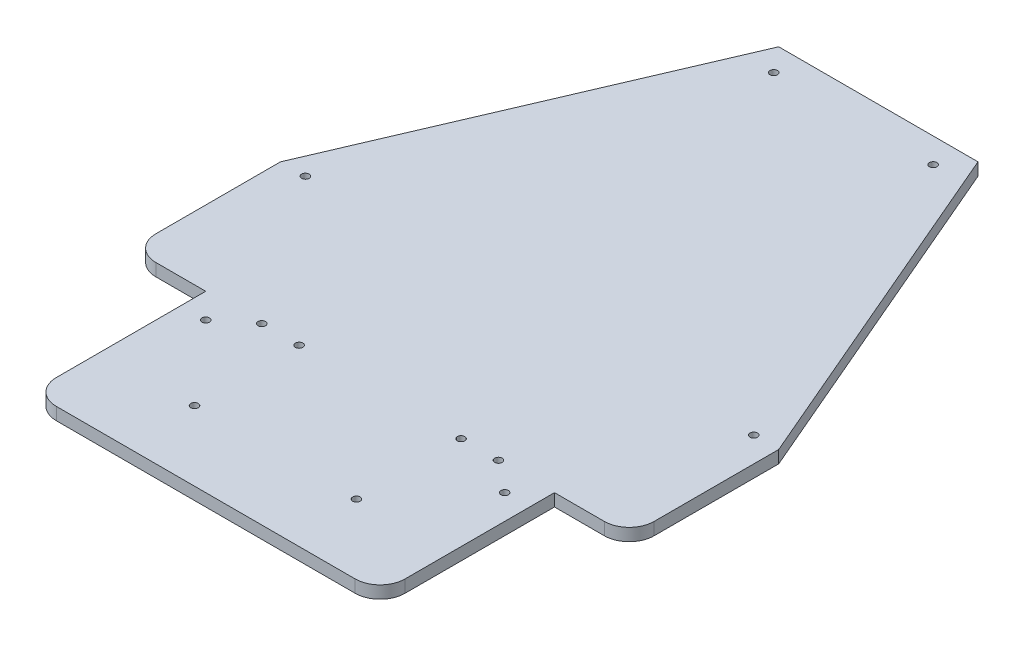
ISO-10303-21;
HEADER;
FILE_DESCRIPTION(('STEP AP214'),'2;1');
FILE_NAME('part.step','',(''),(''),'','','');
FILE_SCHEMA(('AUTOMOTIVE_DESIGN { 1 0 10303 214 1 1 1 1 }'));
ENDSEC;
DATA;
#1=APPLICATION_CONTEXT('core data for automotive mechanical design processes');
#2=APPLICATION_PROTOCOL_DEFINITION('international standard','automotive_design',2000,#1);
#3=PRODUCT_CONTEXT('',#1,'mechanical');
#4=PRODUCT('Part','Part','',(#3));
#5=PRODUCT_RELATED_PRODUCT_CATEGORY('part','',(#4));
#6=PRODUCT_DEFINITION_FORMATION('','',#4);
#7=PRODUCT_DEFINITION_CONTEXT('part definition',#1,'design');
#8=PRODUCT_DEFINITION('design','',#6,#7);
#9=PRODUCT_DEFINITION_SHAPE('','',#8);
#10=(LENGTH_UNIT() NAMED_UNIT(*) SI_UNIT(.MILLI.,.METRE.));
#11=(NAMED_UNIT(*) PLANE_ANGLE_UNIT() SI_UNIT($,.RADIAN.));
#12=(NAMED_UNIT(*) SI_UNIT($,.STERADIAN.) SOLID_ANGLE_UNIT());
#13=UNCERTAINTY_MEASURE_WITH_UNIT(LENGTH_MEASURE(1.E-05),#10,'distance_accuracy_value','');
#14=(GEOMETRIC_REPRESENTATION_CONTEXT(3) GLOBAL_UNCERTAINTY_ASSIGNED_CONTEXT((#13)) GLOBAL_UNIT_ASSIGNED_CONTEXT((#10,
#11,#12)) REPRESENTATION_CONTEXT('',''));
#15=CARTESIAN_POINT('',(0.,0.,0.));
#16=DIRECTION('',(0.,0.,1.));
#17=DIRECTION('',(1.,0.,0.));
#18=AXIS2_PLACEMENT_3D('',#15,#16,#17);
#19=CARTESIAN_POINT('',(90.,5.,40.));
#20=DIRECTION('',(0.,1.,0.));
#21=DIRECTION('',(0.,0.,1.));
#22=AXIS2_PLACEMENT_3D('',#19,#20,#21);
#23=PLANE('',#22);
#24=CARTESIAN_POINT('',(47.5,5.,50.));
#25=DIRECTION('',(0.,1.,0.));
#26=DIRECTION('',(0.,0.,1.));
#27=AXIS2_PLACEMENT_3D('',#24,#25,#26);
#28=CIRCLE('',#27,1.5);
#29=CARTESIAN_POINT('',(47.5,5.,51.5));
#30=VERTEX_POINT('',#29);
#31=EDGE_CURVE('E292',#30,#30,#28,.T.);
#32=ORIENTED_EDGE('',*,*,#31,.F.);
#33=EDGE_LOOP('',(#32));
#34=FACE_BOUND('',#33,.T.);
#35=CARTESIAN_POINT('',(32.5,5.,50.));
#36=DIRECTION('',(0.,1.,0.));
#37=DIRECTION('',(0.,0.,1.));
#38=AXIS2_PLACEMENT_3D('',#35,#36,#37);
#39=CIRCLE('',#38,1.5);
#40=CARTESIAN_POINT('',(32.5,5.,51.5));
#41=VERTEX_POINT('',#40);
#42=EDGE_CURVE('E668',#41,#41,#39,.T.);
#43=ORIENTED_EDGE('',*,*,#42,.F.);
#44=EDGE_LOOP('',(#43));
#45=FACE_BOUND('',#44,.T.);
#46=CARTESIAN_POINT('',(-32.5,5.,50.));
#47=DIRECTION('',(0.,1.,0.));
#48=DIRECTION('',(0.,0.,-1.));
#49=AXIS2_PLACEMENT_3D('',#46,#47,#48);
#50=CIRCLE('',#49,1.5);
#51=CARTESIAN_POINT('',(-32.5,5.,48.5));
#52=VERTEX_POINT('',#51);
#53=EDGE_CURVE('E672',#52,#52,#50,.T.);
#54=ORIENTED_EDGE('',*,*,#53,.F.);
#55=EDGE_LOOP('',(#54));
#56=FACE_BOUND('',#55,.T.);
#57=CARTESIAN_POINT('',(-32.5,5.,92.));
#58=DIRECTION('',(0.,1.,0.));
#59=DIRECTION('',(0.,0.,-1.));
#60=AXIS2_PLACEMENT_3D('',#57,#58,#59);
#61=CIRCLE('',#60,1.5);
#62=CARTESIAN_POINT('',(-32.5,5.,90.5));
#63=VERTEX_POINT('',#62);
#64=EDGE_CURVE('E678',#63,#63,#61,.T.);
#65=ORIENTED_EDGE('',*,*,#64,.F.);
#66=EDGE_LOOP('',(#65));
#67=FACE_BOUND('',#66,.T.);
#68=CARTESIAN_POINT('',(32.5,5.,92.));
#69=DIRECTION('',(0.,1.,0.));
#70=DIRECTION('',(0.,0.,1.));
#71=AXIS2_PLACEMENT_3D('',#68,#69,#70);
#72=CIRCLE('',#71,1.5);
#73=CARTESIAN_POINT('',(32.5,5.,93.5));
#74=VERTEX_POINT('',#73);
#75=EDGE_CURVE('E682',#74,#74,#72,.T.);
#76=ORIENTED_EDGE('',*,*,#75,.F.);
#77=EDGE_LOOP('',(#76));
#78=FACE_BOUND('',#77,.T.);
#79=CARTESIAN_POINT('',(-47.5,5.,50.));
#80=DIRECTION('',(0.,1.,0.));
#81=DIRECTION('',(0.,0.,-1.));
#82=AXIS2_PLACEMENT_3D('',#79,#80,#81);
#83=CIRCLE('',#82,1.5);
#84=CARTESIAN_POINT('',(-47.5,5.,48.5));
#85=VERTEX_POINT('',#84);
#86=EDGE_CURVE('E685',#85,#85,#83,.T.);
#87=ORIENTED_EDGE('',*,*,#86,.F.);
#88=EDGE_LOOP('',(#87));
#89=FACE_BOUND('',#88,.T.);
#90=CARTESIAN_POINT('',(-89.9999999999999,5.,-10.));
#91=DIRECTION('',(0.,1.,0.));
#92=DIRECTION('',(0.,0.,1.));
#93=AXIS2_PLACEMENT_3D('',#90,#91,#92);
#94=CIRCLE('',#93,1.50000000000001);
#95=CARTESIAN_POINT('',(-89.9999999999999,5.,-8.49999999999999));
#96=VERTEX_POINT('',#95);
#97=EDGE_CURVE('E274',#96,#96,#94,.T.);
#98=ORIENTED_EDGE('',*,*,#97,.F.);
#99=EDGE_LOOP('',(#98));
#100=FACE_BOUND('',#99,.T.);
#101=CARTESIAN_POINT('',(32.,5.,-140.));
#102=DIRECTION('',(0.,1.,0.));
#103=DIRECTION('',(0.,0.,-1.));
#104=AXIS2_PLACEMENT_3D('',#101,#102,#103);
#105=CIRCLE('',#104,1.49999999999999);
#106=CARTESIAN_POINT('',(32.,5.,-141.5));
#107=VERTEX_POINT('',#106);
#108=EDGE_CURVE('E310',#107,#107,#105,.T.);
#109=ORIENTED_EDGE('',*,*,#108,.F.);
#110=EDGE_LOOP('',(#109));
#111=FACE_BOUND('',#110,.T.);
#112=CARTESIAN_POINT('',(89.9999999999999,5.,-10.0000000000001));
#113=DIRECTION('',(0.,1.,0.));
#114=DIRECTION('',(0.,0.,-1.));
#115=AXIS2_PLACEMENT_3D('',#112,#113,#114);
#116=CIRCLE('',#115,1.49999999999998);
#117=CARTESIAN_POINT('',(89.9999999999999,5.,-11.5));
#118=VERTEX_POINT('',#117);
#119=EDGE_CURVE('E315',#118,#118,#116,.T.);
#120=ORIENTED_EDGE('',*,*,#119,.F.);
#121=EDGE_LOOP('',(#120));
#122=FACE_BOUND('',#121,.T.);
#123=CARTESIAN_POINT('',(-32.,5.,-140.));
#124=DIRECTION('',(0.,1.,0.));
#125=DIRECTION('',(0.,0.,1.));
#126=AXIS2_PLACEMENT_3D('',#123,#124,#125);
#127=CIRCLE('',#126,1.5);
#128=CARTESIAN_POINT('',(-32.,5.,-138.5));
#129=VERTEX_POINT('',#128);
#130=EDGE_CURVE('E321',#129,#129,#127,.T.);
#131=ORIENTED_EDGE('',*,*,#130,.F.);
#132=EDGE_LOOP('',(#131));
#133=FACE_BOUND('',#132,.T.);
#134=CARTESIAN_POINT('',(-60.,5.,59.9999999999999));
#135=DIRECTION('',(0.,1.,0.));
#136=DIRECTION('',(0.,0.,1.));
#137=AXIS2_PLACEMENT_3D('',#134,#135,#136);
#138=CIRCLE('',#137,1.5);
#139=CARTESIAN_POINT('',(-60.,5.,61.4999999999999));
#140=VERTEX_POINT('',#139);
#141=EDGE_CURVE('E189',#140,#140,#138,.T.);
#142=ORIENTED_EDGE('',*,*,#141,.F.);
#143=EDGE_LOOP('',(#142));
#144=FACE_BOUND('',#143,.T.);
#145=DIRECTION('',(1.,0.,0.));
#146=VECTOR('',#145,1.);
#147=CARTESIAN_POINT('',(70.,5.,50.));
#148=LINE('',#147,#146);
#149=CARTESIAN_POINT('',(70.,5.,50.));
#150=VERTEX_POINT('',#149);
#151=CARTESIAN_POINT('',(89.9999999999999,5.,50.));
#152=VERTEX_POINT('',#151);
#153=EDGE_CURVE('E227',#150,#152,#148,.T.);
#154=ORIENTED_EDGE('',*,*,#153,.T.);
#155=CARTESIAN_POINT('',(90.,5.,40.));
#156=DIRECTION('',(0.,1.,0.));
#157=DIRECTION('',(0.,0.,1.));
#158=AXIS2_PLACEMENT_3D('',#155,#156,#157);
#159=CIRCLE('',#158,9.99999999999999);
#160=CARTESIAN_POINT('',(100.,5.,39.9999999999999));
#161=VERTEX_POINT('',#160);
#162=EDGE_CURVE('E122',#152,#161,#159,.T.);
#163=ORIENTED_EDGE('',*,*,#162,.T.);
#164=DIRECTION('',(0.,0.,-1.));
#165=VECTOR('',#164,1.);
#166=CARTESIAN_POINT('',(100.,5.,39.9999999999999));
#167=LINE('',#166,#165);
#168=CARTESIAN_POINT('',(100.,5.,-9.99999999999999));
#169=VERTEX_POINT('',#168);
#170=EDGE_CURVE('E347',#161,#169,#167,.T.);
#171=ORIENTED_EDGE('',*,*,#170,.T.);
#172=DIRECTION('',(-0.393919298579168,0.,-0.919145030018058));
#173=VECTOR('',#172,1.);
#174=CARTESIAN_POINT('',(40.,5.,-150.));
#175=LINE('',#174,#173);
#176=CARTESIAN_POINT('',(40.,5.,-150.));
#177=VERTEX_POINT('',#176);
#178=EDGE_CURVE('E350',#169,#177,#175,.T.);
#179=ORIENTED_EDGE('',*,*,#178,.T.);
#180=DIRECTION('',(-1.,0.,0.));
#181=VECTOR('',#180,1.);
#182=CARTESIAN_POINT('',(-40.,5.,-150.));
#183=LINE('',#182,#181);
#184=CARTESIAN_POINT('',(-40.,5.,-150.));
#185=VERTEX_POINT('',#184);
#186=EDGE_CURVE('E353',#177,#185,#183,.T.);
#187=ORIENTED_EDGE('',*,*,#186,.T.);
#188=DIRECTION('',(-0.393919298579168,0.,0.919145030018058));
#189=VECTOR('',#188,1.);
#190=CARTESIAN_POINT('',(-40.,5.,-150.));
#191=LINE('',#190,#189);
#192=CARTESIAN_POINT('',(-100.,5.,-9.99999999999999));
#193=VERTEX_POINT('',#192);
#194=EDGE_CURVE('E356',#185,#193,#191,.T.);
#195=ORIENTED_EDGE('',*,*,#194,.T.);
#196=DIRECTION('',(0.,0.,1.));
#197=VECTOR('',#196,1.);
#198=CARTESIAN_POINT('',(-100.,5.,39.9999999999999));
#199=LINE('',#198,#197);
#200=CARTESIAN_POINT('',(-100.,5.,39.9999999999999));
#201=VERTEX_POINT('',#200);
#202=EDGE_CURVE('E359',#193,#201,#199,.T.);
#203=ORIENTED_EDGE('',*,*,#202,.T.);
#204=CARTESIAN_POINT('',(-90.,5.,40.));
#205=DIRECTION('',(0.,1.,0.));
#206=DIRECTION('',(0.,0.,-1.));
#207=AXIS2_PLACEMENT_3D('',#204,#205,#206);
#208=CIRCLE('',#207,9.99999999999999);
#209=CARTESIAN_POINT('',(-89.9999999999999,5.,50.));
#210=VERTEX_POINT('',#209);
#211=EDGE_CURVE('E362',#201,#210,#208,.T.);
#212=ORIENTED_EDGE('',*,*,#211,.T.);
#213=DIRECTION('',(1.,0.,0.));
#214=VECTOR('',#213,1.);
#215=CARTESIAN_POINT('',(-70.,5.,50.));
#216=LINE('',#215,#214);
#217=CARTESIAN_POINT('',(-70.,5.,50.));
#218=VERTEX_POINT('',#217);
#219=EDGE_CURVE('E365',#210,#218,#216,.T.);
#220=ORIENTED_EDGE('',*,*,#219,.T.);
#221=DIRECTION('',(0.,0.,1.));
#222=VECTOR('',#221,1.);
#223=CARTESIAN_POINT('',(-70.,5.,59.9999999999999));
#224=LINE('',#223,#222);
#225=CARTESIAN_POINT('',(-70.,5.,110.));
#226=VERTEX_POINT('',#225);
#227=EDGE_CURVE('E368',#218,#226,#224,.T.);
#228=ORIENTED_EDGE('',*,*,#227,.T.);
#229=CARTESIAN_POINT('',(-60.,5.,110.));
#230=DIRECTION('',(0.,1.,0.));
#231=DIRECTION('',(0.,0.,1.));
#232=AXIS2_PLACEMENT_3D('',#229,#230,#231);
#233=CIRCLE('',#232,10.);
#234=CARTESIAN_POINT('',(-59.9999999999999,5.,120.));
#235=VERTEX_POINT('',#234);
#236=EDGE_CURVE('E160',#226,#235,#233,.T.);
#237=ORIENTED_EDGE('',*,*,#236,.T.);
#238=DIRECTION('',(1.,0.,0.));
#239=VECTOR('',#238,1.);
#240=CARTESIAN_POINT('',(-59.9999999999999,5.,120.));
#241=LINE('',#240,#239);
#242=CARTESIAN_POINT('',(59.9999999999999,5.,120.));
#243=VERTEX_POINT('',#242);
#244=EDGE_CURVE('E153',#235,#243,#241,.T.);
#245=ORIENTED_EDGE('',*,*,#244,.T.);
#246=CARTESIAN_POINT('',(60.,5.,110.));
#247=DIRECTION('',(0.,1.,0.));
#248=DIRECTION('',(0.,0.,1.));
#249=AXIS2_PLACEMENT_3D('',#246,#247,#248);
#250=CIRCLE('',#249,10.);
#251=CARTESIAN_POINT('',(70.,5.,110.));
#252=VERTEX_POINT('',#251);
#253=EDGE_CURVE('E157',#243,#252,#250,.T.);
#254=ORIENTED_EDGE('',*,*,#253,.T.);
#255=DIRECTION('',(0.,0.,-1.));
#256=VECTOR('',#255,1.);
#257=CARTESIAN_POINT('',(70.,5.,110.));
#258=LINE('',#257,#256);
#259=EDGE_CURVE('E63',#252,#150,#258,.T.);
#260=ORIENTED_EDGE('',*,*,#259,.T.);
#261=EDGE_LOOP('',(#154,#163,#171,#179,#187,#195,#203,#212,#220,#228,#237,#245,#254,#260));
#262=FACE_BOUND('',#261,.T.);
#263=CARTESIAN_POINT('',(60.,5.,59.9999999999999));
#264=DIRECTION('',(0.,1.,0.));
#265=DIRECTION('',(0.,0.,-1.));
#266=AXIS2_PLACEMENT_3D('',#263,#264,#265);
#267=CIRCLE('',#266,1.5);
#268=CARTESIAN_POINT('',(60.,5.,58.4999999999999));
#269=VERTEX_POINT('',#268);
#270=EDGE_CURVE('E329',#269,#269,#267,.T.);
#271=ORIENTED_EDGE('',*,*,#270,.F.);
#272=EDGE_LOOP('',(#271));
#273=FACE_BOUND('',#272,.T.);
#274=ADVANCED_FACE('F43',(#34,#45,#56,#67,#78,#89,#100,#111,#122,#133,#144,#262,#273),#23,.T.);
#275=CARTESIAN_POINT('',(90.,0.,40.));
#276=DIRECTION('',(0.,1.,0.));
#277=DIRECTION('',(0.,0.,1.));
#278=AXIS2_PLACEMENT_3D('',#275,#276,#277);
#279=PLANE('',#278);
#280=CARTESIAN_POINT('',(47.5,0.,50.));
#281=DIRECTION('',(0.,1.,0.));
#282=DIRECTION('',(0.,0.,1.));
#283=AXIS2_PLACEMENT_3D('',#280,#281,#282);
#284=CIRCLE('',#283,1.5);
#285=CARTESIAN_POINT('',(47.5,0.,51.5));
#286=VERTEX_POINT('',#285);
#287=EDGE_CURVE('E47',#286,#286,#284,.T.);
#288=ORIENTED_EDGE('',*,*,#287,.T.);
#289=EDGE_LOOP('',(#288));
#290=FACE_BOUND('',#289,.T.);
#291=CARTESIAN_POINT('',(32.5,0.,50.));
#292=DIRECTION('',(0.,1.,0.));
#293=DIRECTION('',(0.,0.,1.));
#294=AXIS2_PLACEMENT_3D('',#291,#292,#293);
#295=CIRCLE('',#294,1.5);
#296=CARTESIAN_POINT('',(32.5,0.,51.5));
#297=VERTEX_POINT('',#296);
#298=EDGE_CURVE('E303',#297,#297,#295,.T.);
#299=ORIENTED_EDGE('',*,*,#298,.T.);
#300=EDGE_LOOP('',(#299));
#301=FACE_BOUND('',#300,.T.);
#302=CARTESIAN_POINT('',(-32.5,0.,50.));
#303=DIRECTION('',(0.,1.,0.));
#304=DIRECTION('',(0.,0.,1.));
#305=AXIS2_PLACEMENT_3D('',#302,#303,#304);
#306=CIRCLE('',#305,1.5);
#307=CARTESIAN_POINT('',(-32.5,0.,51.5));
#308=VERTEX_POINT('',#307);
#309=EDGE_CURVE('E300',#308,#308,#306,.T.);
#310=ORIENTED_EDGE('',*,*,#309,.T.);
#311=EDGE_LOOP('',(#310));
#312=FACE_BOUND('',#311,.T.);
#313=CARTESIAN_POINT('',(-32.5,0.,92.));
#314=DIRECTION('',(0.,1.,0.));
#315=DIRECTION('',(0.,0.,1.));
#316=AXIS2_PLACEMENT_3D('',#313,#314,#315);
#317=CIRCLE('',#316,1.5);
#318=CARTESIAN_POINT('',(-32.5,0.,93.5));
#319=VERTEX_POINT('',#318);
#320=EDGE_CURVE('E296',#319,#319,#317,.T.);
#321=ORIENTED_EDGE('',*,*,#320,.T.);
#322=EDGE_LOOP('',(#321));
#323=FACE_BOUND('',#322,.T.);
#324=CARTESIAN_POINT('',(32.5,0.,92.));
#325=DIRECTION('',(0.,1.,0.));
#326=DIRECTION('',(0.,0.,1.));
#327=AXIS2_PLACEMENT_3D('',#324,#325,#326);
#328=CIRCLE('',#327,1.5);
#329=CARTESIAN_POINT('',(32.5,0.,93.5));
#330=VERTEX_POINT('',#329);
#331=EDGE_CURVE('E291',#330,#330,#328,.T.);
#332=ORIENTED_EDGE('',*,*,#331,.T.);
#333=EDGE_LOOP('',(#332));
#334=FACE_BOUND('',#333,.T.);
#335=CARTESIAN_POINT('',(-47.5,0.,50.));
#336=DIRECTION('',(0.,1.,0.));
#337=DIRECTION('',(0.,0.,1.));
#338=AXIS2_PLACEMENT_3D('',#335,#336,#337);
#339=CIRCLE('',#338,1.5);
#340=CARTESIAN_POINT('',(-47.5,0.,51.5));
#341=VERTEX_POINT('',#340);
#342=EDGE_CURVE('E287',#341,#341,#339,.T.);
#343=ORIENTED_EDGE('',*,*,#342,.T.);
#344=EDGE_LOOP('',(#343));
#345=FACE_BOUND('',#344,.T.);
#346=CARTESIAN_POINT('',(-89.9999999999999,0.,-10.));
#347=DIRECTION('',(0.,1.,0.));
#348=DIRECTION('',(0.,0.,1.));
#349=AXIS2_PLACEMENT_3D('',#346,#347,#348);
#350=CIRCLE('',#349,1.50000000000001);
#351=CARTESIAN_POINT('',(-89.9999999999999,0.,-8.49999999999999));
#352=VERTEX_POINT('',#351);
#353=EDGE_CURVE('E282',#352,#352,#350,.T.);
#354=ORIENTED_EDGE('',*,*,#353,.T.);
#355=EDGE_LOOP('',(#354));
#356=FACE_BOUND('',#355,.T.);
#357=CARTESIAN_POINT('',(32.,0.,-140.));
#358=DIRECTION('',(0.,1.,0.));
#359=DIRECTION('',(0.,0.,1.));
#360=AXIS2_PLACEMENT_3D('',#357,#358,#359);
#361=CIRCLE('',#360,1.49999999999999);
#362=CARTESIAN_POINT('',(32.,0.,-138.5));
#363=VERTEX_POINT('',#362);
#364=EDGE_CURVE('E278',#363,#363,#361,.T.);
#365=ORIENTED_EDGE('',*,*,#364,.T.);
#366=EDGE_LOOP('',(#365));
#367=FACE_BOUND('',#366,.T.);
#368=CARTESIAN_POINT('',(89.9999999999999,0.,-10.0000000000001));
#369=DIRECTION('',(0.,1.,0.));
#370=DIRECTION('',(0.,0.,1.));
#371=AXIS2_PLACEMENT_3D('',#368,#369,#370);
#372=CIRCLE('',#371,1.49999999999998);
#373=CARTESIAN_POINT('',(89.9999999999999,0.,-8.50000000000007));
#374=VERTEX_POINT('',#373);
#375=EDGE_CURVE('E273',#374,#374,#372,.T.);
#376=ORIENTED_EDGE('',*,*,#375,.T.);
#377=EDGE_LOOP('',(#376));
#378=FACE_BOUND('',#377,.T.);
#379=CARTESIAN_POINT('',(-32.,0.,-140.));
#380=DIRECTION('',(0.,1.,0.));
#381=DIRECTION('',(0.,0.,1.));
#382=AXIS2_PLACEMENT_3D('',#379,#380,#381);
#383=CIRCLE('',#382,1.5);
#384=CARTESIAN_POINT('',(-32.,0.,-138.5));
#385=VERTEX_POINT('',#384);
#386=EDGE_CURVE('E269',#385,#385,#383,.T.);
#387=ORIENTED_EDGE('',*,*,#386,.T.);
#388=EDGE_LOOP('',(#387));
#389=FACE_BOUND('',#388,.T.);
#390=DIRECTION('',(1.,0.,0.));
#391=VECTOR('',#390,1.);
#392=CARTESIAN_POINT('',(70.,0.,50.));
#393=LINE('',#392,#391);
#394=CARTESIAN_POINT('',(70.,0.,50.));
#395=VERTEX_POINT('',#394);
#396=CARTESIAN_POINT('',(89.9999999999999,0.,50.));
#397=VERTEX_POINT('',#396);
#398=EDGE_CURVE('E184',#395,#397,#393,.T.);
#399=ORIENTED_EDGE('',*,*,#398,.F.);
#400=DIRECTION('',(0.,0.,-1.));
#401=VECTOR('',#400,1.);
#402=CARTESIAN_POINT('',(70.,0.,59.9999999999999));
#403=LINE('',#402,#401);
#404=CARTESIAN_POINT('',(70.,0.,110.));
#405=VERTEX_POINT('',#404);
#406=EDGE_CURVE('E110',#405,#395,#403,.T.);
#407=ORIENTED_EDGE('',*,*,#406,.F.);
#408=CARTESIAN_POINT('',(60.,0.,110.));
#409=DIRECTION('',(0.,1.,0.));
#410=DIRECTION('',(0.,0.,1.));
#411=AXIS2_PLACEMENT_3D('',#408,#409,#410);
#412=CIRCLE('',#411,10.);
#413=CARTESIAN_POINT('',(59.9999999999999,0.,120.));
#414=VERTEX_POINT('',#413);
#415=EDGE_CURVE('E222',#414,#405,#412,.T.);
#416=ORIENTED_EDGE('',*,*,#415,.F.);
#417=DIRECTION('',(1.,0.,0.));
#418=VECTOR('',#417,1.);
#419=CARTESIAN_POINT('',(-59.9999999999999,0.,120.));
#420=LINE('',#419,#418);
#421=CARTESIAN_POINT('',(-59.9999999999999,0.,120.));
#422=VERTEX_POINT('',#421);
#423=EDGE_CURVE('E170',#422,#414,#420,.T.);
#424=ORIENTED_EDGE('',*,*,#423,.F.);
#425=CARTESIAN_POINT('',(-60.,0.,110.));
#426=DIRECTION('',(0.,1.,0.));
#427=DIRECTION('',(0.,0.,1.));
#428=AXIS2_PLACEMENT_3D('',#425,#426,#427);
#429=CIRCLE('',#428,10.);
#430=CARTESIAN_POINT('',(-70.,0.,110.));
#431=VERTEX_POINT('',#430);
#432=EDGE_CURVE('E217',#431,#422,#429,.T.);
#433=ORIENTED_EDGE('',*,*,#432,.F.);
#434=DIRECTION('',(0.,0.,1.));
#435=VECTOR('',#434,1.);
#436=CARTESIAN_POINT('',(-70.,0.,59.9999999999999));
#437=LINE('',#436,#435);
#438=CARTESIAN_POINT('',(-70.,0.,50.));
#439=VERTEX_POINT('',#438);
#440=EDGE_CURVE('E214',#439,#431,#437,.T.);
#441=ORIENTED_EDGE('',*,*,#440,.F.);
#442=DIRECTION('',(1.,0.,0.));
#443=VECTOR('',#442,1.);
#444=CARTESIAN_POINT('',(-70.,0.,50.));
#445=LINE('',#444,#443);
#446=CARTESIAN_POINT('',(-89.9999999999999,0.,50.));
#447=VERTEX_POINT('',#446);
#448=EDGE_CURVE('E210',#447,#439,#445,.T.);
#449=ORIENTED_EDGE('',*,*,#448,.F.);
#450=CARTESIAN_POINT('',(-90.,0.,40.));
#451=DIRECTION('',(0.,1.,0.));
#452=DIRECTION('',(0.,0.,-1.));
#453=AXIS2_PLACEMENT_3D('',#450,#451,#452);
#454=CIRCLE('',#453,9.99999999999999);
#455=CARTESIAN_POINT('',(-100.,0.,39.9999999999999));
#456=VERTEX_POINT('',#455);
#457=EDGE_CURVE('E207',#456,#447,#454,.T.);
#458=ORIENTED_EDGE('',*,*,#457,.F.);
#459=DIRECTION('',(0.,0.,1.));
#460=VECTOR('',#459,1.);
#461=CARTESIAN_POINT('',(-100.,0.,39.9999999999999));
#462=LINE('',#461,#460);
#463=CARTESIAN_POINT('',(-100.,0.,-9.99999999999999));
#464=VERTEX_POINT('',#463);
#465=EDGE_CURVE('E204',#464,#456,#462,.T.);
#466=ORIENTED_EDGE('',*,*,#465,.F.);
#467=DIRECTION('',(-0.393919298579168,0.,0.919145030018058));
#468=VECTOR('',#467,1.);
#469=CARTESIAN_POINT('',(-40.,0.,-150.));
#470=LINE('',#469,#468);
#471=CARTESIAN_POINT('',(-40.,0.,-150.));
#472=VERTEX_POINT('',#471);
#473=EDGE_CURVE('E201',#472,#464,#470,.T.);
#474=ORIENTED_EDGE('',*,*,#473,.F.);
#475=DIRECTION('',(-1.,0.,0.));
#476=VECTOR('',#475,1.);
#477=CARTESIAN_POINT('',(-40.,0.,-150.));
#478=LINE('',#477,#476);
#479=CARTESIAN_POINT('',(40.,0.,-150.));
#480=VERTEX_POINT('',#479);
#481=EDGE_CURVE('E198',#480,#472,#478,.T.);
#482=ORIENTED_EDGE('',*,*,#481,.F.);
#483=DIRECTION('',(-0.393919298579168,0.,-0.919145030018058));
#484=VECTOR('',#483,1.);
#485=CARTESIAN_POINT('',(40.,0.,-150.));
#486=LINE('',#485,#484);
#487=CARTESIAN_POINT('',(100.,0.,-9.99999999999999));
#488=VERTEX_POINT('',#487);
#489=EDGE_CURVE('E195',#488,#480,#486,.T.);
#490=ORIENTED_EDGE('',*,*,#489,.F.);
#491=DIRECTION('',(0.,0.,-1.));
#492=VECTOR('',#491,1.);
#493=CARTESIAN_POINT('',(100.,0.,39.9999999999999));
#494=LINE('',#493,#492);
#495=CARTESIAN_POINT('',(100.,0.,39.9999999999999));
#496=VERTEX_POINT('',#495);
#497=EDGE_CURVE('E192',#496,#488,#494,.T.);
#498=ORIENTED_EDGE('',*,*,#497,.F.);
#499=CARTESIAN_POINT('',(90.,0.,40.));
#500=DIRECTION('',(0.,1.,0.));
#501=DIRECTION('',(0.,0.,1.));
#502=AXIS2_PLACEMENT_3D('',#499,#500,#501);
#503=CIRCLE('',#502,9.99999999999999);
#504=EDGE_CURVE('E188',#397,#496,#503,.T.);
#505=ORIENTED_EDGE('',*,*,#504,.F.);
#506=EDGE_LOOP('',(#399,#407,#416,#424,#433,#441,#449,#458,#466,#474,#482,#490,#498,#505));
#507=FACE_BOUND('',#506,.T.);
#508=CARTESIAN_POINT('',(-60.,0.,59.9999999999999));
#509=DIRECTION('',(0.,1.,0.));
#510=DIRECTION('',(0.,0.,1.));
#511=AXIS2_PLACEMENT_3D('',#508,#509,#510);
#512=CIRCLE('',#511,1.5);
#513=CARTESIAN_POINT('',(-60.,0.,61.4999999999999));
#514=VERTEX_POINT('',#513);
#515=EDGE_CURVE('E333',#514,#514,#512,.T.);
#516=ORIENTED_EDGE('',*,*,#515,.T.);
#517=EDGE_LOOP('',(#516));
#518=FACE_BOUND('',#517,.T.);
#519=CARTESIAN_POINT('',(60.,0.,59.9999999999999));
#520=DIRECTION('',(0.,1.,0.));
#521=DIRECTION('',(0.,0.,-1.));
#522=AXIS2_PLACEMENT_3D('',#519,#520,#521);
#523=CIRCLE('',#522,1.5);
#524=CARTESIAN_POINT('',(60.,0.,58.4999999999999));
#525=VERTEX_POINT('',#524);
#526=EDGE_CURVE('E286',#525,#525,#523,.T.);
#527=ORIENTED_EDGE('',*,*,#526,.T.);
#528=EDGE_LOOP('',(#527));
#529=FACE_BOUND('',#528,.T.);
#530=ADVANCED_FACE('F380',(#290,#301,#312,#323,#334,#345,#356,#367,#378,#389,#507,#518,#529),
#279,.F.);
#531=CARTESIAN_POINT('',(70.,5.,50.));
#532=DIRECTION('',(0.,0.,-1.));
#533=DIRECTION('',(-1.,0.,0.));
#534=AXIS2_PLACEMENT_3D('',#531,#532,#533);
#535=PLANE('',#534);
#536=ORIENTED_EDGE('',*,*,#398,.T.);
#537=DIRECTION('',(0.,-1.,0.));
#538=VECTOR('',#537,1.);
#539=CARTESIAN_POINT('',(89.9999999999999,5.,50.));
#540=LINE('',#539,#538);
#541=EDGE_CURVE('E11',#152,#397,#540,.T.);
#542=ORIENTED_EDGE('',*,*,#541,.F.);
#543=ORIENTED_EDGE('',*,*,#153,.F.);
#544=DIRECTION('',(0.,-1.,0.));
#545=VECTOR('',#544,1.);
#546=CARTESIAN_POINT('',(70.,5.,50.));
#547=LINE('',#546,#545);
#548=EDGE_CURVE('E180',#150,#395,#547,.T.);
#549=ORIENTED_EDGE('',*,*,#548,.T.);
#550=EDGE_LOOP('',(#536,#542,#543,#549));
#551=FACE_BOUND('',#550,.T.);
#552=ADVANCED_FACE('F45',(#551),#535,.F.);
#553=CARTESIAN_POINT('',(90.,5.,40.));
#554=DIRECTION('',(0.,-1.,0.));
#555=DIRECTION('',(0.,0.,-1.));
#556=AXIS2_PLACEMENT_3D('',#553,#554,#555);
#557=CYLINDRICAL_SURFACE('',#556,9.99999999999999);
#558=ORIENTED_EDGE('',*,*,#504,.T.);
#559=DIRECTION('',(0.,-1.,0.));
#560=VECTOR('',#559,1.);
#561=CARTESIAN_POINT('',(100.,5.,39.9999999999999));
#562=LINE('',#561,#560);
#563=EDGE_CURVE('E54',#161,#496,#562,.T.);
#564=ORIENTED_EDGE('',*,*,#563,.F.);
#565=ORIENTED_EDGE('',*,*,#162,.F.);
#566=ORIENTED_EDGE('',*,*,#541,.T.);
#567=EDGE_LOOP('',(#558,#564,#565,#566));
#568=FACE_BOUND('',#567,.T.);
#569=ADVANCED_FACE('F455',(#568),#557,.T.);
#570=CARTESIAN_POINT('',(100.,5.,39.9999999999999));
#571=DIRECTION('',(-1.,0.,0.));
#572=DIRECTION('',(0.,0.,1.));
#573=AXIS2_PLACEMENT_3D('',#570,#571,#572);
#574=PLANE('',#573);
#575=ORIENTED_EDGE('',*,*,#497,.T.);
#576=DIRECTION('',(0.,-1.,0.));
#577=VECTOR('',#576,1.);
#578=CARTESIAN_POINT('',(100.,5.,-9.99999999999999));
#579=LINE('',#578,#577);
#580=EDGE_CURVE('E262',#169,#488,#579,.T.);
#581=ORIENTED_EDGE('',*,*,#580,.F.);
#582=ORIENTED_EDGE('',*,*,#170,.F.);
#583=ORIENTED_EDGE('',*,*,#563,.T.);
#584=EDGE_LOOP('',(#575,#581,#582,#583));
#585=FACE_BOUND('',#584,.T.);
#586=ADVANCED_FACE('F452',(#585),#574,.F.);
#587=CARTESIAN_POINT('',(40.,5.,-150.));
#588=DIRECTION('',(-0.919145030018058,0.,0.393919298579168));
#589=DIRECTION('',(0.393919298579168,0.,0.919145030018058));
#590=AXIS2_PLACEMENT_3D('',#587,#588,#589);
#591=PLANE('',#590);
#592=ORIENTED_EDGE('',*,*,#489,.T.);
#593=DIRECTION('',(0.,-1.,0.));
#594=VECTOR('',#593,1.);
#595=CARTESIAN_POINT('',(40.,5.,-150.));
#596=LINE('',#595,#594);
#597=EDGE_CURVE('E258',#177,#480,#596,.T.);
#598=ORIENTED_EDGE('',*,*,#597,.F.);
#599=ORIENTED_EDGE('',*,*,#178,.F.);
#600=ORIENTED_EDGE('',*,*,#580,.T.);
#601=EDGE_LOOP('',(#592,#598,#599,#600));
#602=FACE_BOUND('',#601,.T.);
#603=ADVANCED_FACE('F448',(#602),#591,.F.);
#604=CARTESIAN_POINT('',(-40.,5.,-150.));
#605=DIRECTION('',(0.,0.,1.));
#606=DIRECTION('',(1.,0.,0.));
#607=AXIS2_PLACEMENT_3D('',#604,#605,#606);
#608=PLANE('',#607);
#609=ORIENTED_EDGE('',*,*,#481,.T.);
#610=DIRECTION('',(0.,-1.,0.));
#611=VECTOR('',#610,1.);
#612=CARTESIAN_POINT('',(-40.,5.,-150.));
#613=LINE('',#612,#611);
#614=EDGE_CURVE('E254',#185,#472,#613,.T.);
#615=ORIENTED_EDGE('',*,*,#614,.F.);
#616=ORIENTED_EDGE('',*,*,#186,.F.);
#617=ORIENTED_EDGE('',*,*,#597,.T.);
#618=EDGE_LOOP('',(#609,#615,#616,#617));
#619=FACE_BOUND('',#618,.T.);
#620=ADVANCED_FACE('F444',(#619),#608,.F.);
#621=CARTESIAN_POINT('',(-40.,5.,-150.));
#622=DIRECTION('',(0.919145030018058,0.,0.393919298579168));
#623=DIRECTION('',(0.393919298579168,0.,-0.919145030018058));
#624=AXIS2_PLACEMENT_3D('',#621,#622,#623);
#625=PLANE('',#624);
#626=ORIENTED_EDGE('',*,*,#473,.T.);
#627=DIRECTION('',(0.,-1.,0.));
#628=VECTOR('',#627,1.);
#629=CARTESIAN_POINT('',(-100.,5.,-9.99999999999999));
#630=LINE('',#629,#628);
#631=EDGE_CURVE('E250',#193,#464,#630,.T.);
#632=ORIENTED_EDGE('',*,*,#631,.F.);
#633=ORIENTED_EDGE('',*,*,#194,.F.);
#634=ORIENTED_EDGE('',*,*,#614,.T.);
#635=EDGE_LOOP('',(#626,#632,#633,#634));
#636=FACE_BOUND('',#635,.T.);
#637=ADVANCED_FACE('F440',(#636),#625,.F.);
#638=CARTESIAN_POINT('',(-100.,5.,39.9999999999999));
#639=DIRECTION('',(1.,0.,0.));
#640=DIRECTION('',(0.,0.,-1.));
#641=AXIS2_PLACEMENT_3D('',#638,#639,#640);
#642=PLANE('',#641);
#643=ORIENTED_EDGE('',*,*,#465,.T.);
#644=DIRECTION('',(0.,-1.,0.));
#645=VECTOR('',#644,1.);
#646=CARTESIAN_POINT('',(-100.,5.,39.9999999999999));
#647=LINE('',#646,#645);
#648=EDGE_CURVE('E246',#201,#456,#647,.T.);
#649=ORIENTED_EDGE('',*,*,#648,.F.);
#650=ORIENTED_EDGE('',*,*,#202,.F.);
#651=ORIENTED_EDGE('',*,*,#631,.T.);
#652=EDGE_LOOP('',(#643,#649,#650,#651));
#653=FACE_BOUND('',#652,.T.);
#654=ADVANCED_FACE('F436',(#653),#642,.F.);
#655=CARTESIAN_POINT('',(-90.,5.,40.));
#656=DIRECTION('',(0.,-1.,0.));
#657=DIRECTION('',(0.,0.,-1.));
#658=AXIS2_PLACEMENT_3D('',#655,#656,#657);
#659=CYLINDRICAL_SURFACE('',#658,9.99999999999999);
#660=ORIENTED_EDGE('',*,*,#457,.T.);
#661=DIRECTION('',(0.,-1.,0.));
#662=VECTOR('',#661,1.);
#663=CARTESIAN_POINT('',(-89.9999999999999,5.,50.));
#664=LINE('',#663,#662);
#665=EDGE_CURVE('E242',#210,#447,#664,.T.);
#666=ORIENTED_EDGE('',*,*,#665,.F.);
#667=ORIENTED_EDGE('',*,*,#211,.F.);
#668=ORIENTED_EDGE('',*,*,#648,.T.);
#669=EDGE_LOOP('',(#660,#666,#667,#668));
#670=FACE_BOUND('',#669,.T.);
#671=ADVANCED_FACE('F432',(#670),#659,.T.);
#672=CARTESIAN_POINT('',(-70.,5.,50.));
#673=DIRECTION('',(0.,0.,-1.));
#674=DIRECTION('',(-1.,0.,0.));
#675=AXIS2_PLACEMENT_3D('',#672,#673,#674);
#676=PLANE('',#675);
#677=ORIENTED_EDGE('',*,*,#448,.T.);
#678=DIRECTION('',(0.,-1.,0.));
#679=VECTOR('',#678,1.);
#680=CARTESIAN_POINT('',(-70.,5.,50.));
#681=LINE('',#680,#679);
#682=EDGE_CURVE('E238',#218,#439,#681,.T.);
#683=ORIENTED_EDGE('',*,*,#682,.F.);
#684=ORIENTED_EDGE('',*,*,#219,.F.);
#685=ORIENTED_EDGE('',*,*,#665,.T.);
#686=EDGE_LOOP('',(#677,#683,#684,#685));
#687=FACE_BOUND('',#686,.T.);
#688=ADVANCED_FACE('F428',(#687),#676,.F.);
#689=CARTESIAN_POINT('',(-70.,5.,59.9999999999999));
#690=DIRECTION('',(1.,0.,0.));
#691=DIRECTION('',(0.,0.,-1.));
#692=AXIS2_PLACEMENT_3D('',#689,#690,#691);
#693=PLANE('',#692);
#694=ORIENTED_EDGE('',*,*,#440,.T.);
#695=DIRECTION('',(0.,-1.,0.));
#696=VECTOR('',#695,1.);
#697=CARTESIAN_POINT('',(-70.,5.,110.));
#698=LINE('',#697,#696);
#699=EDGE_CURVE('E234',#226,#431,#698,.T.);
#700=ORIENTED_EDGE('',*,*,#699,.F.);
#701=ORIENTED_EDGE('',*,*,#227,.F.);
#702=ORIENTED_EDGE('',*,*,#682,.T.);
#703=EDGE_LOOP('',(#694,#700,#701,#702));
#704=FACE_BOUND('',#703,.T.);
#705=ADVANCED_FACE('F424',(#704),#693,.F.);
#706=CARTESIAN_POINT('',(-60.,5.,110.));
#707=DIRECTION('',(0.,-1.,0.));
#708=DIRECTION('',(0.,0.,-1.));
#709=AXIS2_PLACEMENT_3D('',#706,#707,#708);
#710=CYLINDRICAL_SURFACE('',#709,10.);
#711=ORIENTED_EDGE('',*,*,#432,.T.);
#712=DIRECTION('',(0.,-1.,0.));
#713=VECTOR('',#712,1.);
#714=CARTESIAN_POINT('',(-59.9999999999999,5.,120.));
#715=LINE('',#714,#713);
#716=EDGE_CURVE('E173',#235,#422,#715,.T.);
#717=ORIENTED_EDGE('',*,*,#716,.F.);
#718=ORIENTED_EDGE('',*,*,#236,.F.);
#719=ORIENTED_EDGE('',*,*,#699,.T.);
#720=EDGE_LOOP('',(#711,#717,#718,#719));
#721=FACE_BOUND('',#720,.T.);
#722=ADVANCED_FACE('F421',(#721),#710,.T.);
#723=CARTESIAN_POINT('',(-59.9999999999999,5.,120.));
#724=DIRECTION('',(0.,0.,-1.));
#725=DIRECTION('',(-1.,0.,0.));
#726=AXIS2_PLACEMENT_3D('',#723,#724,#725);
#727=PLANE('',#726);
#728=ORIENTED_EDGE('',*,*,#423,.T.);
#729=DIRECTION('',(0.,-1.,0.));
#730=VECTOR('',#729,1.);
#731=CARTESIAN_POINT('',(59.9999999999999,5.,120.));
#732=LINE('',#731,#730);
#733=EDGE_CURVE('E167',#243,#414,#732,.T.);
#734=ORIENTED_EDGE('',*,*,#733,.F.);
#735=ORIENTED_EDGE('',*,*,#244,.F.);
#736=ORIENTED_EDGE('',*,*,#716,.T.);
#737=EDGE_LOOP('',(#728,#734,#735,#736));
#738=FACE_BOUND('',#737,.T.);
#739=ADVANCED_FACE('F168',(#738),#727,.F.);
#740=CARTESIAN_POINT('',(60.,5.,110.));
#741=DIRECTION('',(0.,-1.,0.));
#742=DIRECTION('',(0.,0.,-1.));
#743=AXIS2_PLACEMENT_3D('',#740,#741,#742);
#744=CYLINDRICAL_SURFACE('',#743,10.);
#745=ORIENTED_EDGE('',*,*,#415,.T.);
#746=DIRECTION('',(0.,-1.,0.));
#747=VECTOR('',#746,1.);
#748=CARTESIAN_POINT('',(70.,5.,110.));
#749=LINE('',#748,#747);
#750=EDGE_CURVE('E174',#252,#405,#749,.T.);
#751=ORIENTED_EDGE('',*,*,#750,.F.);
#752=ORIENTED_EDGE('',*,*,#253,.F.);
#753=ORIENTED_EDGE('',*,*,#733,.T.);
#754=EDGE_LOOP('',(#745,#751,#752,#753));
#755=FACE_BOUND('',#754,.T.);
#756=ADVANCED_FACE('F176',(#755),#744,.T.);
#757=CARTESIAN_POINT('',(70.,5.,59.9999999999999));
#758=DIRECTION('',(-1.,0.,0.));
#759=DIRECTION('',(0.,0.,1.));
#760=AXIS2_PLACEMENT_3D('',#757,#758,#759);
#761=PLANE('',#760);
#762=ORIENTED_EDGE('',*,*,#406,.T.);
#763=ORIENTED_EDGE('',*,*,#548,.F.);
#764=ORIENTED_EDGE('',*,*,#259,.F.);
#765=ORIENTED_EDGE('',*,*,#750,.T.);
#766=EDGE_LOOP('',(#762,#763,#764,#765));
#767=FACE_BOUND('',#766,.T.);
#768=ADVANCED_FACE('F394',(#767),#761,.F.);
#769=CARTESIAN_POINT('',(-60.,5.,59.9999999999999));
#770=DIRECTION('',(0.,-1.,0.));
#771=DIRECTION('',(0.,0.,-1.));
#772=AXIS2_PLACEMENT_3D('',#769,#770,#771);
#773=CYLINDRICAL_SURFACE('',#772,1.5);
#774=ORIENTED_EDGE('',*,*,#141,.T.);
#775=EDGE_LOOP('',(#774));
#776=FACE_BOUND('',#775,.T.);
#777=ORIENTED_EDGE('',*,*,#515,.F.);
#778=EDGE_LOOP('',(#777));
#779=FACE_BOUND('',#778,.T.);
#780=ADVANCED_FACE('F390',(#776,#779),#773,.F.);
#781=CARTESIAN_POINT('',(60.,5.,59.9999999999999));
#782=DIRECTION('',(0.,-1.,0.));
#783=DIRECTION('',(0.,0.,-1.));
#784=AXIS2_PLACEMENT_3D('',#781,#782,#783);
#785=CYLINDRICAL_SURFACE('',#784,1.5);
#786=ORIENTED_EDGE('',*,*,#270,.T.);
#787=EDGE_LOOP('',(#786));
#788=FACE_BOUND('',#787,.T.);
#789=ORIENTED_EDGE('',*,*,#526,.F.);
#790=EDGE_LOOP('',(#789));
#791=FACE_BOUND('',#790,.T.);
#792=ADVANCED_FACE('F393',(#788,#791),#785,.F.);
#793=CARTESIAN_POINT('',(-32.,-5.,-140.));
#794=DIRECTION('',(0.,1.,0.));
#795=DIRECTION('',(0.,0.,1.));
#796=AXIS2_PLACEMENT_3D('',#793,#794,#795);
#797=CYLINDRICAL_SURFACE('',#796,1.5);
#798=ORIENTED_EDGE('',*,*,#130,.T.);
#799=EDGE_LOOP('',(#798));
#800=FACE_BOUND('',#799,.T.);
#801=ORIENTED_EDGE('',*,*,#386,.F.);
#802=EDGE_LOOP('',(#801));
#803=FACE_BOUND('',#802,.T.);
#804=ADVANCED_FACE('F404',(#800,#803),#797,.F.);
#805=CARTESIAN_POINT('',(89.9999999999999,-5.,-10.0000000000001));
#806=DIRECTION('',(0.,1.,0.));
#807=DIRECTION('',(0.,0.,1.));
#808=AXIS2_PLACEMENT_3D('',#805,#806,#807);
#809=CYLINDRICAL_SURFACE('',#808,1.49999999999998);
#810=ORIENTED_EDGE('',*,*,#119,.T.);
#811=EDGE_LOOP('',(#810));
#812=FACE_BOUND('',#811,.T.);
#813=ORIENTED_EDGE('',*,*,#375,.F.);
#814=EDGE_LOOP('',(#813));
#815=FACE_BOUND('',#814,.T.);
#816=ADVANCED_FACE('F410',(#812,#815),#809,.F.);
#817=CARTESIAN_POINT('',(32.,-5.,-140.));
#818=DIRECTION('',(0.,1.,0.));
#819=DIRECTION('',(0.,0.,1.));
#820=AXIS2_PLACEMENT_3D('',#817,#818,#819);
#821=CYLINDRICAL_SURFACE('',#820,1.49999999999999);
#822=ORIENTED_EDGE('',*,*,#108,.T.);
#823=EDGE_LOOP('',(#822));
#824=FACE_BOUND('',#823,.T.);
#825=ORIENTED_EDGE('',*,*,#364,.F.);
#826=EDGE_LOOP('',(#825));
#827=FACE_BOUND('',#826,.T.);
#828=ADVANCED_FACE('F511',(#824,#827),#821,.F.);
#829=CARTESIAN_POINT('',(-89.9999999999999,-5.,-10.));
#830=DIRECTION('',(0.,1.,0.));
#831=DIRECTION('',(0.,0.,1.));
#832=AXIS2_PLACEMENT_3D('',#829,#830,#831);
#833=CYLINDRICAL_SURFACE('',#832,1.50000000000001);
#834=ORIENTED_EDGE('',*,*,#97,.T.);
#835=EDGE_LOOP('',(#834));
#836=FACE_BOUND('',#835,.T.);
#837=ORIENTED_EDGE('',*,*,#353,.F.);
#838=EDGE_LOOP('',(#837));
#839=FACE_BOUND('',#838,.T.);
#840=ADVANCED_FACE('F375',(#836,#839),#833,.F.);
#841=CARTESIAN_POINT('',(-47.5,-5.,50.));
#842=DIRECTION('',(0.,1.,0.));
#843=DIRECTION('',(0.,0.,1.));
#844=AXIS2_PLACEMENT_3D('',#841,#842,#843);
#845=CYLINDRICAL_SURFACE('',#844,1.5);
#846=ORIENTED_EDGE('',*,*,#86,.T.);
#847=EDGE_LOOP('',(#846));
#848=FACE_BOUND('',#847,.T.);
#849=ORIENTED_EDGE('',*,*,#342,.F.);
#850=EDGE_LOOP('',(#849));
#851=FACE_BOUND('',#850,.T.);
#852=ADVANCED_FACE('F510',(#848,#851),#845,.F.);
#853=CARTESIAN_POINT('',(32.5,-5.,92.));
#854=DIRECTION('',(0.,1.,0.));
#855=DIRECTION('',(0.,0.,1.));
#856=AXIS2_PLACEMENT_3D('',#853,#854,#855);
#857=CYLINDRICAL_SURFACE('',#856,1.5);
#858=ORIENTED_EDGE('',*,*,#75,.T.);
#859=EDGE_LOOP('',(#858));
#860=FACE_BOUND('',#859,.T.);
#861=ORIENTED_EDGE('',*,*,#331,.F.);
#862=EDGE_LOOP('',(#861));
#863=FACE_BOUND('',#862,.T.);
#864=ADVANCED_FACE('F642',(#860,#863),#857,.F.);
#865=CARTESIAN_POINT('',(-32.5,-5.,92.));
#866=DIRECTION('',(0.,1.,0.));
#867=DIRECTION('',(0.,0.,1.));
#868=AXIS2_PLACEMENT_3D('',#865,#866,#867);
#869=CYLINDRICAL_SURFACE('',#868,1.5);
#870=ORIENTED_EDGE('',*,*,#64,.T.);
#871=EDGE_LOOP('',(#870));
#872=FACE_BOUND('',#871,.T.);
#873=ORIENTED_EDGE('',*,*,#320,.F.);
#874=EDGE_LOOP('',(#873));
#875=FACE_BOUND('',#874,.T.);
#876=ADVANCED_FACE('F646',(#872,#875),#869,.F.);
#877=CARTESIAN_POINT('',(-32.5,-5.,50.));
#878=DIRECTION('',(0.,1.,0.));
#879=DIRECTION('',(0.,0.,1.));
#880=AXIS2_PLACEMENT_3D('',#877,#878,#879);
#881=CYLINDRICAL_SURFACE('',#880,1.5);
#882=ORIENTED_EDGE('',*,*,#53,.T.);
#883=EDGE_LOOP('',(#882));
#884=FACE_BOUND('',#883,.T.);
#885=ORIENTED_EDGE('',*,*,#309,.F.);
#886=EDGE_LOOP('',(#885));
#887=FACE_BOUND('',#886,.T.);
#888=ADVANCED_FACE('F650',(#884,#887),#881,.F.);
#889=CARTESIAN_POINT('',(32.5,-5.,50.));
#890=DIRECTION('',(0.,1.,0.));
#891=DIRECTION('',(0.,0.,1.));
#892=AXIS2_PLACEMENT_3D('',#889,#890,#891);
#893=CYLINDRICAL_SURFACE('',#892,1.5);
#894=ORIENTED_EDGE('',*,*,#42,.T.);
#895=EDGE_LOOP('',(#894));
#896=FACE_BOUND('',#895,.T.);
#897=ORIENTED_EDGE('',*,*,#298,.F.);
#898=EDGE_LOOP('',(#897));
#899=FACE_BOUND('',#898,.T.);
#900=ADVANCED_FACE('F654',(#896,#899),#893,.F.);
#901=CARTESIAN_POINT('',(47.5,-5.,50.));
#902=DIRECTION('',(0.,1.,0.));
#903=DIRECTION('',(0.,0.,1.));
#904=AXIS2_PLACEMENT_3D('',#901,#902,#903);
#905=CYLINDRICAL_SURFACE('',#904,1.5);
#906=ORIENTED_EDGE('',*,*,#31,.T.);
#907=EDGE_LOOP('',(#906));
#908=FACE_BOUND('',#907,.T.);
#909=ORIENTED_EDGE('',*,*,#287,.F.);
#910=EDGE_LOOP('',(#909));
#911=FACE_BOUND('',#910,.T.);
#912=ADVANCED_FACE('F658',(#908,#911),#905,.F.);
#913=CLOSED_SHELL('',(#274,#530,#552,#569,#586,#603,#620,#637,#654,#671,#688,#705,#722,#739,
#756,#768,#780,#792,#804,#816,#828,#840,#852,#864,#876,#888,#900,#912));
#914=MANIFOLD_SOLID_BREP('B2',#913);
#915=ADVANCED_BREP_SHAPE_REPRESENTATION('',(#18,#914),#14);
#916=SHAPE_DEFINITION_REPRESENTATION(#9,#915);
ENDSEC;
END-ISO-10303-21;
